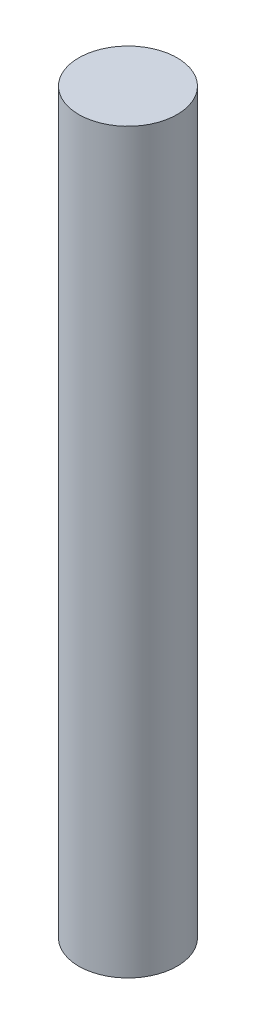
ISO-10303-21;
HEADER;
FILE_DESCRIPTION(('STEP AP214'),'2;1');
FILE_NAME('part.step','',(''),(''),'','','');
FILE_SCHEMA(('AUTOMOTIVE_DESIGN { 1 0 10303 214 1 1 1 1 }'));
ENDSEC;
DATA;
#1=APPLICATION_CONTEXT('core data for automotive mechanical design processes');
#2=APPLICATION_PROTOCOL_DEFINITION('international standard','automotive_design',2000,#1);
#3=PRODUCT_CONTEXT('',#1,'mechanical');
#4=PRODUCT('Part','Part','',(#3));
#5=PRODUCT_RELATED_PRODUCT_CATEGORY('part','',(#4));
#6=PRODUCT_DEFINITION_FORMATION('','',#4);
#7=PRODUCT_DEFINITION_CONTEXT('part definition',#1,'design');
#8=PRODUCT_DEFINITION('design','',#6,#7);
#9=PRODUCT_DEFINITION_SHAPE('','',#8);
#10=(LENGTH_UNIT() NAMED_UNIT(*) SI_UNIT(.MILLI.,.METRE.));
#11=(NAMED_UNIT(*) PLANE_ANGLE_UNIT() SI_UNIT($,.RADIAN.));
#12=(NAMED_UNIT(*) SI_UNIT($,.STERADIAN.) SOLID_ANGLE_UNIT());
#13=UNCERTAINTY_MEASURE_WITH_UNIT(LENGTH_MEASURE(1.E-05),#10,'distance_accuracy_value','');
#14=(GEOMETRIC_REPRESENTATION_CONTEXT(3) GLOBAL_UNCERTAINTY_ASSIGNED_CONTEXT((#13)) GLOBAL_UNIT_ASSIGNED_CONTEXT((#10,
#11,#12)) REPRESENTATION_CONTEXT('',''));
#15=CARTESIAN_POINT('',(0.,0.,0.));
#16=DIRECTION('',(0.,0.,1.));
#17=DIRECTION('',(1.,0.,0.));
#18=AXIS2_PLACEMENT_3D('',#15,#16,#17);
#19=CARTESIAN_POINT('',(0.,30.,0.));
#20=DIRECTION('',(0.,-1.,0.));
#21=DIRECTION('',(0.,0.,-1.));
#22=AXIS2_PLACEMENT_3D('',#19,#20,#21);
#23=CYLINDRICAL_SURFACE('',#22,2.);
#24=CARTESIAN_POINT('',(0.,30.,0.));
#25=DIRECTION('',(0.,1.,0.));
#26=DIRECTION('',(0.,0.,1.));
#27=AXIS2_PLACEMENT_3D('',#24,#25,#26);
#28=CIRCLE('',#27,2.);
#29=CARTESIAN_POINT('',(0.,30.,2.));
#30=VERTEX_POINT('',#29);
#31=EDGE_CURVE('E10',#30,#30,#28,.T.);
#32=ORIENTED_EDGE('',*,*,#31,.F.);
#33=EDGE_LOOP('',(#32));
#34=FACE_BOUND('',#33,.T.);
#35=CARTESIAN_POINT('',(0.,0.,0.));
#36=DIRECTION('',(0.,1.,0.));
#37=DIRECTION('',(0.,0.,1.));
#38=AXIS2_PLACEMENT_3D('',#35,#36,#37);
#39=CIRCLE('',#38,2.);
#40=CARTESIAN_POINT('',(0.,0.,2.));
#41=VERTEX_POINT('',#40);
#42=EDGE_CURVE('E36',#41,#41,#39,.T.);
#43=ORIENTED_EDGE('',*,*,#42,.T.);
#44=EDGE_LOOP('',(#43));
#45=FACE_BOUND('',#44,.T.);
#46=ADVANCED_FACE('F33',(#34,#45),#23,.T.);
#47=CARTESIAN_POINT('',(0.,30.,0.));
#48=DIRECTION('',(0.,1.,0.));
#49=DIRECTION('',(0.,0.,1.));
#50=AXIS2_PLACEMENT_3D('',#47,#48,#49);
#51=PLANE('',#50);
#52=ORIENTED_EDGE('',*,*,#31,.T.);
#53=EDGE_LOOP('',(#52));
#54=FACE_BOUND('',#53,.T.);
#55=ADVANCED_FACE('F48',(#54),#51,.T.);
#56=CARTESIAN_POINT('',(0.,0.,0.));
#57=DIRECTION('',(0.,1.,0.));
#58=DIRECTION('',(0.,0.,1.));
#59=AXIS2_PLACEMENT_3D('',#56,#57,#58);
#60=PLANE('',#59);
#61=ORIENTED_EDGE('',*,*,#42,.F.);
#62=EDGE_LOOP('',(#61));
#63=FACE_BOUND('',#62,.T.);
#64=ADVANCED_FACE('F46',(#63),#60,.F.);
#65=CLOSED_SHELL('',(#46,#55,#64));
#66=MANIFOLD_SOLID_BREP('B2',#65);
#67=ADVANCED_BREP_SHAPE_REPRESENTATION('',(#18,#66),#14);
#68=SHAPE_DEFINITION_REPRESENTATION(#9,#67);
ENDSEC;
END-ISO-10303-21;
